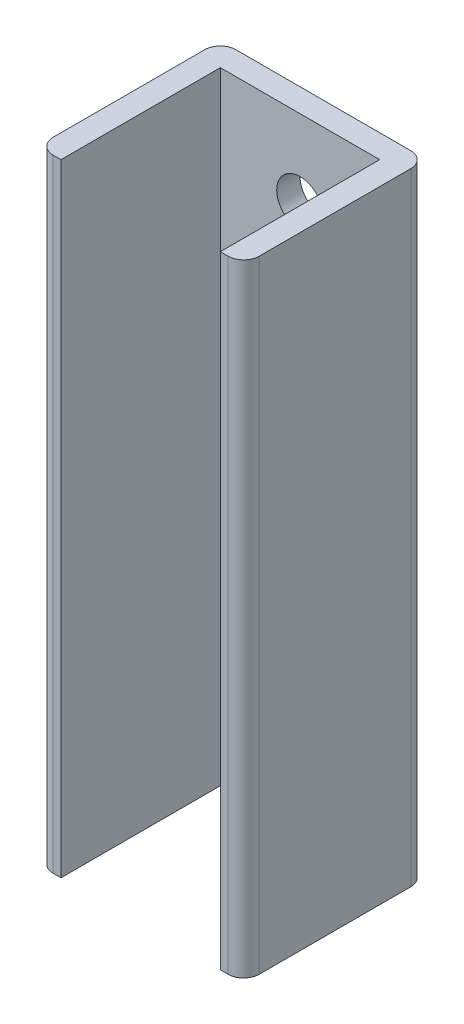
ISO-10303-21;
HEADER;
FILE_DESCRIPTION(('STEP AP214'),'2;1');
FILE_NAME('part.step','',(''),(''),'','','');
FILE_SCHEMA(('AUTOMOTIVE_DESIGN { 1 0 10303 214 1 1 1 1 }'));
ENDSEC;
DATA;
#1=APPLICATION_CONTEXT('core data for automotive mechanical design processes');
#2=APPLICATION_PROTOCOL_DEFINITION('international standard','automotive_design',2000,#1);
#3=PRODUCT_CONTEXT('',#1,'mechanical');
#4=PRODUCT('Part','Part','',(#3));
#5=PRODUCT_RELATED_PRODUCT_CATEGORY('part','',(#4));
#6=PRODUCT_DEFINITION_FORMATION('','',#4);
#7=PRODUCT_DEFINITION_CONTEXT('part definition',#1,'design');
#8=PRODUCT_DEFINITION('design','',#6,#7);
#9=PRODUCT_DEFINITION_SHAPE('','',#8);
#10=(LENGTH_UNIT() NAMED_UNIT(*) SI_UNIT(.MILLI.,.METRE.));
#11=(NAMED_UNIT(*) PLANE_ANGLE_UNIT() SI_UNIT($,.RADIAN.));
#12=(NAMED_UNIT(*) SI_UNIT($,.STERADIAN.) SOLID_ANGLE_UNIT());
#13=UNCERTAINTY_MEASURE_WITH_UNIT(LENGTH_MEASURE(1.E-05),#10,'distance_accuracy_value','');
#14=(GEOMETRIC_REPRESENTATION_CONTEXT(3) GLOBAL_UNCERTAINTY_ASSIGNED_CONTEXT((#13)) GLOBAL_UNIT_ASSIGNED_CONTEXT((#10,
#11,#12)) REPRESENTATION_CONTEXT('',''));
#15=CARTESIAN_POINT('',(0.,0.,0.));
#16=DIRECTION('',(0.,0.,1.));
#17=DIRECTION('',(1.,0.,0.));
#18=AXIS2_PLACEMENT_3D('',#15,#16,#17);
#19=CARTESIAN_POINT('',(0.,80.,-13.25));
#20=DIRECTION('',(0.,0.,-1.));
#21=DIRECTION('',(-1.,0.,0.));
#22=AXIS2_PLACEMENT_3D('',#19,#20,#21);
#23=PLANE('',#22);
#24=CARTESIAN_POINT('',(0.,70.,-13.25));
#25=DIRECTION('',(0.,0.,-1.));
#26=DIRECTION('',(-1.,0.,0.));
#27=AXIS2_PLACEMENT_3D('',#24,#25,#26);
#28=CIRCLE('',#27,3.);
#29=CARTESIAN_POINT('',(-3.,70.,-13.25));
#30=VERTEX_POINT('',#29);
#31=EDGE_CURVE('E241',#30,#30,#28,.T.);
#32=ORIENTED_EDGE('',*,*,#31,.F.);
#33=EDGE_LOOP('',(#32));
#34=FACE_BOUND('',#33,.T.);
#35=CARTESIAN_POINT('',(0.,10.,-13.25));
#36=DIRECTION('',(0.,0.,-1.));
#37=DIRECTION('',(-1.,0.,0.));
#38=AXIS2_PLACEMENT_3D('',#35,#36,#37);
#39=CIRCLE('',#38,3.);
#40=CARTESIAN_POINT('',(-3.00000000000001,10.,-13.25));
#41=VERTEX_POINT('',#40);
#42=EDGE_CURVE('E248',#41,#41,#39,.T.);
#43=ORIENTED_EDGE('',*,*,#42,.F.);
#44=EDGE_LOOP('',(#43));
#45=FACE_BOUND('',#44,.T.);
#46=DIRECTION('',(1.,0.,0.));
#47=VECTOR('',#46,1.);
#48=CARTESIAN_POINT('',(0.,0.,-13.25));
#49=LINE('',#48,#47);
#50=CARTESIAN_POINT('',(-11.25,0.,-13.25));
#51=VERTEX_POINT('',#50);
#52=CARTESIAN_POINT('',(11.25,0.,-13.25));
#53=VERTEX_POINT('',#52);
#54=EDGE_CURVE('E171',#51,#53,#49,.T.);
#55=ORIENTED_EDGE('',*,*,#54,.F.);
#56=DIRECTION('',(0.,-1.,0.));
#57=VECTOR('',#56,1.);
#58=CARTESIAN_POINT('',(-11.25,80.,-13.25));
#59=LINE('',#58,#57);
#60=CARTESIAN_POINT('',(-11.25,80.,-13.25));
#61=VERTEX_POINT('',#60);
#62=EDGE_CURVE('E11',#61,#51,#59,.T.);
#63=ORIENTED_EDGE('',*,*,#62,.F.);
#64=DIRECTION('',(1.,0.,0.));
#65=VECTOR('',#64,1.);
#66=CARTESIAN_POINT('',(0.,80.,-13.25));
#67=LINE('',#66,#65);
#68=CARTESIAN_POINT('',(11.25,80.,-13.25));
#69=VERTEX_POINT('',#68);
#70=EDGE_CURVE('E210',#61,#69,#67,.T.);
#71=ORIENTED_EDGE('',*,*,#70,.T.);
#72=DIRECTION('',(0.,-1.,0.));
#73=VECTOR('',#72,1.);
#74=CARTESIAN_POINT('',(11.25,80.,-13.25));
#75=LINE('',#74,#73);
#76=EDGE_CURVE('E60',#69,#53,#75,.T.);
#77=ORIENTED_EDGE('',*,*,#76,.T.);
#78=EDGE_LOOP('',(#55,#63,#71,#77));
#79=FACE_BOUND('',#78,.T.);
#80=ADVANCED_FACE('F41',(#34,#45,#79),#23,.T.);
#81=CARTESIAN_POINT('',(-11.25,80.,-11.25));
#82=DIRECTION('',(0.,-1.,0.));
#83=DIRECTION('',(0.,0.,-1.));
#84=AXIS2_PLACEMENT_3D('',#81,#82,#83);
#85=CYLINDRICAL_SURFACE('',#84,2.);
#86=CARTESIAN_POINT('',(-11.25,0.,-11.25));
#87=DIRECTION('',(0.,1.,0.));
#88=DIRECTION('',(0.,0.,1.));
#89=AXIS2_PLACEMENT_3D('',#86,#87,#88);
#90=CIRCLE('',#89,2.);
#91=CARTESIAN_POINT('',(-13.25,0.,-11.25));
#92=VERTEX_POINT('',#91);
#93=EDGE_CURVE('E174',#51,#92,#90,.T.);
#94=ORIENTED_EDGE('',*,*,#93,.T.);
#95=DIRECTION('',(0.,-1.,0.));
#96=VECTOR('',#95,1.);
#97=CARTESIAN_POINT('',(-13.25,80.,-11.25));
#98=LINE('',#97,#96);
#99=CARTESIAN_POINT('',(-13.25,80.,-11.25));
#100=VERTEX_POINT('',#99);
#101=EDGE_CURVE('E51',#100,#92,#98,.T.);
#102=ORIENTED_EDGE('',*,*,#101,.F.);
#103=CARTESIAN_POINT('',(-11.25,80.,-11.25));
#104=DIRECTION('',(0.,1.,0.));
#105=DIRECTION('',(0.,0.,1.));
#106=AXIS2_PLACEMENT_3D('',#103,#104,#105);
#107=CIRCLE('',#106,2.);
#108=EDGE_CURVE('E258',#61,#100,#107,.T.);
#109=ORIENTED_EDGE('',*,*,#108,.F.);
#110=ORIENTED_EDGE('',*,*,#62,.T.);
#111=EDGE_LOOP('',(#94,#102,#109,#110));
#112=FACE_BOUND('',#111,.T.);
#113=ADVANCED_FACE('F300',(#112),#85,.T.);
#114=CARTESIAN_POINT('',(-13.25,80.,0.));
#115=DIRECTION('',(-1.,0.,0.));
#116=DIRECTION('',(0.,0.,1.));
#117=AXIS2_PLACEMENT_3D('',#114,#115,#116);
#118=PLANE('',#117);
#119=DIRECTION('',(0.,0.,-1.));
#120=VECTOR('',#119,1.);
#121=CARTESIAN_POINT('',(-13.25,0.,0.));
#122=LINE('',#121,#120);
#123=CARTESIAN_POINT('',(-13.25,0.,8.24999999999999));
#124=VERTEX_POINT('',#123);
#125=EDGE_CURVE('E178',#124,#92,#122,.T.);
#126=ORIENTED_EDGE('',*,*,#125,.F.);
#127=DIRECTION('',(0.,-1.,0.));
#128=VECTOR('',#127,1.);
#129=CARTESIAN_POINT('',(-13.25,80.,8.24999999999999));
#130=LINE('',#129,#128);
#131=CARTESIAN_POINT('',(-13.25,80.,8.24999999999999));
#132=VERTEX_POINT('',#131);
#133=EDGE_CURVE('E234',#132,#124,#130,.T.);
#134=ORIENTED_EDGE('',*,*,#133,.F.);
#135=DIRECTION('',(0.,0.,-1.));
#136=VECTOR('',#135,1.);
#137=CARTESIAN_POINT('',(-13.25,80.,0.));
#138=LINE('',#137,#136);
#139=EDGE_CURVE('E261',#132,#100,#138,.T.);
#140=ORIENTED_EDGE('',*,*,#139,.T.);
#141=ORIENTED_EDGE('',*,*,#101,.T.);
#142=EDGE_LOOP('',(#126,#134,#140,#141));
#143=FACE_BOUND('',#142,.T.);
#144=ADVANCED_FACE('F305',(#143),#118,.T.);
#145=CARTESIAN_POINT('',(-11.25,80.,8.25));
#146=DIRECTION('',(0.,-1.,0.));
#147=DIRECTION('',(0.,0.,-1.));
#148=AXIS2_PLACEMENT_3D('',#145,#146,#147);
#149=CYLINDRICAL_SURFACE('',#148,2.);
#150=CARTESIAN_POINT('',(-11.25,0.,8.25));
#151=DIRECTION('',(0.,1.,0.));
#152=DIRECTION('',(0.,0.,1.));
#153=AXIS2_PLACEMENT_3D('',#150,#151,#152);
#154=CIRCLE('',#153,2.);
#155=CARTESIAN_POINT('',(-11.25,0.,10.25));
#156=VERTEX_POINT('',#155);
#157=EDGE_CURVE('E182',#156,#124,#154,.F.);
#158=ORIENTED_EDGE('',*,*,#157,.F.);
#159=DIRECTION('',(0.,-1.,0.));
#160=VECTOR('',#159,1.);
#161=CARTESIAN_POINT('',(-11.25,80.,10.25));
#162=LINE('',#161,#160);
#163=CARTESIAN_POINT('',(-11.25,80.,10.25));
#164=VERTEX_POINT('',#163);
#165=EDGE_CURVE('E231',#164,#156,#162,.T.);
#166=ORIENTED_EDGE('',*,*,#165,.F.);
#167=CARTESIAN_POINT('',(-11.25,80.,8.25));
#168=DIRECTION('',(0.,1.,0.));
#169=DIRECTION('',(0.,0.,1.));
#170=AXIS2_PLACEMENT_3D('',#167,#168,#169);
#171=CIRCLE('',#170,2.);
#172=EDGE_CURVE('E265',#164,#132,#171,.F.);
#173=ORIENTED_EDGE('',*,*,#172,.T.);
#174=ORIENTED_EDGE('',*,*,#133,.T.);
#175=EDGE_LOOP('',(#158,#166,#173,#174));
#176=FACE_BOUND('',#175,.T.);
#177=ADVANCED_FACE('F383',(#176),#149,.T.);
#178=CARTESIAN_POINT('',(0.,80.,10.25));
#179=DIRECTION('',(0.,0.,-1.));
#180=DIRECTION('',(-1.,0.,0.));
#181=AXIS2_PLACEMENT_3D('',#178,#179,#180);
#182=PLANE('',#181);
#183=DIRECTION('',(1.,0.,0.));
#184=VECTOR('',#183,1.);
#185=CARTESIAN_POINT('',(0.,0.,10.25));
#186=LINE('',#185,#184);
#187=CARTESIAN_POINT('',(-10.25,0.,10.25));
#188=VERTEX_POINT('',#187);
#189=EDGE_CURVE('E186',#156,#188,#186,.T.);
#190=ORIENTED_EDGE('',*,*,#189,.T.);
#191=DIRECTION('',(0.,-1.,0.));
#192=VECTOR('',#191,1.);
#193=CARTESIAN_POINT('',(-10.25,80.,10.25));
#194=LINE('',#193,#192);
#195=CARTESIAN_POINT('',(-10.25,80.,10.25));
#196=VERTEX_POINT('',#195);
#197=EDGE_CURVE('E227',#196,#188,#194,.T.);
#198=ORIENTED_EDGE('',*,*,#197,.F.);
#199=DIRECTION('',(1.,0.,0.));
#200=VECTOR('',#199,1.);
#201=CARTESIAN_POINT('',(0.,80.,10.25));
#202=LINE('',#201,#200);
#203=EDGE_CURVE('E165',#164,#196,#202,.T.);
#204=ORIENTED_EDGE('',*,*,#203,.F.);
#205=ORIENTED_EDGE('',*,*,#165,.T.);
#206=EDGE_LOOP('',(#190,#198,#204,#205));
#207=FACE_BOUND('',#206,.T.);
#208=ADVANCED_FACE('F354',(#207),#182,.F.);
#209=CARTESIAN_POINT('',(-10.25,80.,0.));
#210=DIRECTION('',(-1.,0.,0.));
#211=DIRECTION('',(0.,0.,1.));
#212=AXIS2_PLACEMENT_3D('',#209,#210,#211);
#213=PLANE('',#212);
#214=DIRECTION('',(0.,0.,-1.));
#215=VECTOR('',#214,1.);
#216=CARTESIAN_POINT('',(-10.25,0.,0.));
#217=LINE('',#216,#215);
#218=CARTESIAN_POINT('',(-10.25,0.,-10.25));
#219=VERTEX_POINT('',#218);
#220=EDGE_CURVE('E189',#188,#219,#217,.T.);
#221=ORIENTED_EDGE('',*,*,#220,.T.);
#222=DIRECTION('',(0.,-1.,0.));
#223=VECTOR('',#222,1.);
#224=CARTESIAN_POINT('',(-10.25,80.,-10.25));
#225=LINE('',#224,#223);
#226=CARTESIAN_POINT('',(-10.25,80.,-10.25));
#227=VERTEX_POINT('',#226);
#228=EDGE_CURVE('E223',#227,#219,#225,.T.);
#229=ORIENTED_EDGE('',*,*,#228,.F.);
#230=DIRECTION('',(0.,0.,-1.));
#231=VECTOR('',#230,1.);
#232=CARTESIAN_POINT('',(-10.25,80.,0.));
#233=LINE('',#232,#231);
#234=EDGE_CURVE('E270',#196,#227,#233,.T.);
#235=ORIENTED_EDGE('',*,*,#234,.F.);
#236=ORIENTED_EDGE('',*,*,#197,.T.);
#237=EDGE_LOOP('',(#221,#229,#235,#236));
#238=FACE_BOUND('',#237,.T.);
#239=ADVANCED_FACE('F369',(#238),#213,.F.);
#240=CARTESIAN_POINT('',(0.,80.,-10.25));
#241=DIRECTION('',(0.,0.,-1.));
#242=DIRECTION('',(-1.,0.,0.));
#243=AXIS2_PLACEMENT_3D('',#240,#241,#242);
#244=PLANE('',#243);
#245=CARTESIAN_POINT('',(0.,70.,-10.25));
#246=DIRECTION('',(0.,0.,-1.));
#247=DIRECTION('',(-1.,0.,0.));
#248=AXIS2_PLACEMENT_3D('',#245,#246,#247);
#249=CIRCLE('',#248,3.);
#250=CARTESIAN_POINT('',(-3.,70.,-10.25));
#251=VERTEX_POINT('',#250);
#252=EDGE_CURVE('E44',#251,#251,#249,.T.);
#253=ORIENTED_EDGE('',*,*,#252,.T.);
#254=EDGE_LOOP('',(#253));
#255=FACE_BOUND('',#254,.T.);
#256=CARTESIAN_POINT('',(0.,10.,-10.25));
#257=DIRECTION('',(0.,0.,-1.));
#258=DIRECTION('',(-1.,0.,0.));
#259=AXIS2_PLACEMENT_3D('',#256,#257,#258);
#260=CIRCLE('',#259,3.);
#261=CARTESIAN_POINT('',(-3.00000000000001,10.,-10.25));
#262=VERTEX_POINT('',#261);
#263=EDGE_CURVE('E238',#262,#262,#260,.T.);
#264=ORIENTED_EDGE('',*,*,#263,.T.);
#265=EDGE_LOOP('',(#264));
#266=FACE_BOUND('',#265,.T.);
#267=DIRECTION('',(1.,0.,0.));
#268=VECTOR('',#267,1.);
#269=CARTESIAN_POINT('',(0.,0.,-10.25));
#270=LINE('',#269,#268);
#271=CARTESIAN_POINT('',(10.25,0.,-10.25));
#272=VERTEX_POINT('',#271);
#273=EDGE_CURVE('E193',#219,#272,#270,.T.);
#274=ORIENTED_EDGE('',*,*,#273,.T.);
#275=DIRECTION('',(0.,-1.,0.));
#276=VECTOR('',#275,1.);
#277=CARTESIAN_POINT('',(10.25,80.,-10.25));
#278=LINE('',#277,#276);
#279=CARTESIAN_POINT('',(10.25,80.,-10.25));
#280=VERTEX_POINT('',#279);
#281=EDGE_CURVE('E220',#280,#272,#278,.T.);
#282=ORIENTED_EDGE('',*,*,#281,.F.);
#283=DIRECTION('',(1.,0.,0.));
#284=VECTOR('',#283,1.);
#285=CARTESIAN_POINT('',(0.,80.,-10.25));
#286=LINE('',#285,#284);
#287=EDGE_CURVE('E272',#227,#280,#286,.T.);
#288=ORIENTED_EDGE('',*,*,#287,.F.);
#289=ORIENTED_EDGE('',*,*,#228,.T.);
#290=EDGE_LOOP('',(#274,#282,#288,#289));
#291=FACE_BOUND('',#290,.T.);
#292=ADVANCED_FACE('F362',(#255,#266,#291),#244,.F.);
#293=CARTESIAN_POINT('',(10.25,80.,0.));
#294=DIRECTION('',(-1.,0.,0.));
#295=DIRECTION('',(0.,0.,1.));
#296=AXIS2_PLACEMENT_3D('',#293,#294,#295);
#297=PLANE('',#296);
#298=DIRECTION('',(0.,0.,-1.));
#299=VECTOR('',#298,1.);
#300=CARTESIAN_POINT('',(10.25,0.,0.));
#301=LINE('',#300,#299);
#302=CARTESIAN_POINT('',(10.25,0.,10.25));
#303=VERTEX_POINT('',#302);
#304=EDGE_CURVE('E197',#303,#272,#301,.T.);
#305=ORIENTED_EDGE('',*,*,#304,.F.);
#306=DIRECTION('',(0.,-1.,0.));
#307=VECTOR('',#306,1.);
#308=CARTESIAN_POINT('',(10.25,80.,10.25));
#309=LINE('',#308,#307);
#310=CARTESIAN_POINT('',(10.25,80.,10.25));
#311=VERTEX_POINT('',#310);
#312=EDGE_CURVE('E217',#311,#303,#309,.T.);
#313=ORIENTED_EDGE('',*,*,#312,.F.);
#314=DIRECTION('',(0.,0.,-1.));
#315=VECTOR('',#314,1.);
#316=CARTESIAN_POINT('',(10.25,80.,0.));
#317=LINE('',#316,#315);
#318=EDGE_CURVE('E163',#311,#280,#317,.T.);
#319=ORIENTED_EDGE('',*,*,#318,.T.);
#320=ORIENTED_EDGE('',*,*,#281,.T.);
#321=EDGE_LOOP('',(#305,#313,#319,#320));
#322=FACE_BOUND('',#321,.T.);
#323=ADVANCED_FACE('F280',(#322),#297,.T.);
#324=CARTESIAN_POINT('',(11.25,0.,10.25));
#325=VERTEX_POINT('',#324);
#326=EDGE_CURVE('E190',#303,#325,#186,.T.);
#327=ORIENTED_EDGE('',*,*,#326,.T.);
#328=DIRECTION('',(0.,-1.,0.));
#329=VECTOR('',#328,1.);
#330=CARTESIAN_POINT('',(11.25,80.,10.25));
#331=LINE('',#330,#329);
#332=CARTESIAN_POINT('',(11.25,80.,10.25));
#333=VERTEX_POINT('',#332);
#334=EDGE_CURVE('E145',#333,#325,#331,.T.);
#335=ORIENTED_EDGE('',*,*,#334,.F.);
#336=EDGE_CURVE('E158',#311,#333,#202,.T.);
#337=ORIENTED_EDGE('',*,*,#336,.F.);
#338=ORIENTED_EDGE('',*,*,#312,.T.);
#339=EDGE_LOOP('',(#327,#335,#337,#338));
#340=FACE_BOUND('',#339,.T.);
#341=ADVANCED_FACE('F284',(#340),#182,.F.);
#342=CARTESIAN_POINT('',(11.25,80.,8.25));
#343=DIRECTION('',(0.,-1.,0.));
#344=DIRECTION('',(0.,0.,-1.));
#345=AXIS2_PLACEMENT_3D('',#342,#343,#344);
#346=CYLINDRICAL_SURFACE('',#345,2.);
#347=CARTESIAN_POINT('',(11.25,0.,8.25));
#348=DIRECTION('',(0.,1.,0.));
#349=DIRECTION('',(0.,0.,1.));
#350=AXIS2_PLACEMENT_3D('',#347,#348,#349);
#351=CIRCLE('',#350,2.);
#352=CARTESIAN_POINT('',(13.25,0.,8.24999999999999));
#353=VERTEX_POINT('',#352);
#354=EDGE_CURVE('E141',#353,#325,#351,.F.);
#355=ORIENTED_EDGE('',*,*,#354,.F.);
#356=DIRECTION('',(0.,-1.,0.));
#357=VECTOR('',#356,1.);
#358=CARTESIAN_POINT('',(13.25,80.,8.24999999999999));
#359=LINE('',#358,#357);
#360=CARTESIAN_POINT('',(13.25,80.,8.24999999999999));
#361=VERTEX_POINT('',#360);
#362=EDGE_CURVE('E135',#361,#353,#359,.T.);
#363=ORIENTED_EDGE('',*,*,#362,.F.);
#364=CARTESIAN_POINT('',(11.25,80.,8.25));
#365=DIRECTION('',(0.,1.,0.));
#366=DIRECTION('',(0.,0.,1.));
#367=AXIS2_PLACEMENT_3D('',#364,#365,#366);
#368=CIRCLE('',#367,2.);
#369=EDGE_CURVE('E139',#361,#333,#368,.F.);
#370=ORIENTED_EDGE('',*,*,#369,.T.);
#371=ORIENTED_EDGE('',*,*,#334,.T.);
#372=EDGE_LOOP('',(#355,#363,#370,#371));
#373=FACE_BOUND('',#372,.T.);
#374=ADVANCED_FACE('F137',(#373),#346,.T.);
#375=CARTESIAN_POINT('',(13.25,80.,0.));
#376=DIRECTION('',(-1.,0.,0.));
#377=DIRECTION('',(0.,0.,1.));
#378=AXIS2_PLACEMENT_3D('',#375,#376,#377);
#379=PLANE('',#378);
#380=DIRECTION('',(0.,0.,-1.));
#381=VECTOR('',#380,1.);
#382=CARTESIAN_POINT('',(13.25,0.,0.));
#383=LINE('',#382,#381);
#384=CARTESIAN_POINT('',(13.25,0.,-11.25));
#385=VERTEX_POINT('',#384);
#386=EDGE_CURVE('E203',#353,#385,#383,.T.);
#387=ORIENTED_EDGE('',*,*,#386,.T.);
#388=DIRECTION('',(0.,-1.,0.));
#389=VECTOR('',#388,1.);
#390=CARTESIAN_POINT('',(13.25,80.,-11.25));
#391=LINE('',#390,#389);
#392=CARTESIAN_POINT('',(13.25,80.,-11.25));
#393=VERTEX_POINT('',#392);
#394=EDGE_CURVE('E98',#393,#385,#391,.T.);
#395=ORIENTED_EDGE('',*,*,#394,.F.);
#396=DIRECTION('',(0.,0.,-1.));
#397=VECTOR('',#396,1.);
#398=CARTESIAN_POINT('',(13.25,80.,0.));
#399=LINE('',#398,#397);
#400=EDGE_CURVE('E147',#361,#393,#399,.T.);
#401=ORIENTED_EDGE('',*,*,#400,.F.);
#402=ORIENTED_EDGE('',*,*,#362,.T.);
#403=EDGE_LOOP('',(#387,#395,#401,#402));
#404=FACE_BOUND('',#403,.T.);
#405=ADVANCED_FACE('F148',(#404),#379,.F.);
#406=CARTESIAN_POINT('',(11.25,80.,-11.25));
#407=DIRECTION('',(0.,-1.,0.));
#408=DIRECTION('',(0.,0.,-1.));
#409=AXIS2_PLACEMENT_3D('',#406,#407,#408);
#410=CYLINDRICAL_SURFACE('',#409,2.);
#411=CARTESIAN_POINT('',(11.25,0.,-11.25));
#412=DIRECTION('',(0.,1.,0.));
#413=DIRECTION('',(0.,0.,1.));
#414=AXIS2_PLACEMENT_3D('',#411,#412,#413);
#415=CIRCLE('',#414,2.);
#416=EDGE_CURVE('E206',#53,#385,#415,.F.);
#417=ORIENTED_EDGE('',*,*,#416,.F.);
#418=ORIENTED_EDGE('',*,*,#76,.F.);
#419=CARTESIAN_POINT('',(11.25,80.,-11.25));
#420=DIRECTION('',(0.,1.,0.));
#421=DIRECTION('',(0.,0.,1.));
#422=AXIS2_PLACEMENT_3D('',#419,#420,#421);
#423=CIRCLE('',#422,2.);
#424=EDGE_CURVE('E152',#69,#393,#423,.F.);
#425=ORIENTED_EDGE('',*,*,#424,.T.);
#426=ORIENTED_EDGE('',*,*,#394,.T.);
#427=EDGE_LOOP('',(#417,#418,#425,#426));
#428=FACE_BOUND('',#427,.T.);
#429=ADVANCED_FACE('F289',(#428),#410,.T.);
#430=CARTESIAN_POINT('',(0.,80.,0.));
#431=DIRECTION('',(0.,1.,0.));
#432=DIRECTION('',(0.,0.,1.));
#433=AXIS2_PLACEMENT_3D('',#430,#431,#432);
#434=PLANE('',#433);
#435=ORIENTED_EDGE('',*,*,#70,.F.);
#436=ORIENTED_EDGE('',*,*,#108,.T.);
#437=ORIENTED_EDGE('',*,*,#139,.F.);
#438=ORIENTED_EDGE('',*,*,#172,.F.);
#439=ORIENTED_EDGE('',*,*,#203,.T.);
#440=ORIENTED_EDGE('',*,*,#234,.T.);
#441=ORIENTED_EDGE('',*,*,#287,.T.);
#442=ORIENTED_EDGE('',*,*,#318,.F.);
#443=ORIENTED_EDGE('',*,*,#336,.T.);
#444=ORIENTED_EDGE('',*,*,#369,.F.);
#445=ORIENTED_EDGE('',*,*,#400,.T.);
#446=ORIENTED_EDGE('',*,*,#424,.F.);
#447=EDGE_LOOP('',(#435,#436,#437,#438,#439,#440,#441,#442,#443,#444,#445,#446));
#448=FACE_BOUND('',#447,.T.);
#449=ADVANCED_FACE('F155',(#448),#434,.T.);
#450=CARTESIAN_POINT('',(0.,0.,0.));
#451=DIRECTION('',(0.,1.,0.));
#452=DIRECTION('',(0.,0.,1.));
#453=AXIS2_PLACEMENT_3D('',#450,#451,#452);
#454=PLANE('',#453);
#455=ORIENTED_EDGE('',*,*,#54,.T.);
#456=ORIENTED_EDGE('',*,*,#416,.T.);
#457=ORIENTED_EDGE('',*,*,#386,.F.);
#458=ORIENTED_EDGE('',*,*,#354,.T.);
#459=ORIENTED_EDGE('',*,*,#326,.F.);
#460=ORIENTED_EDGE('',*,*,#304,.T.);
#461=ORIENTED_EDGE('',*,*,#273,.F.);
#462=ORIENTED_EDGE('',*,*,#220,.F.);
#463=ORIENTED_EDGE('',*,*,#189,.F.);
#464=ORIENTED_EDGE('',*,*,#157,.T.);
#465=ORIENTED_EDGE('',*,*,#125,.T.);
#466=ORIENTED_EDGE('',*,*,#93,.F.);
#467=EDGE_LOOP('',(#455,#456,#457,#458,#459,#460,#461,#462,#463,#464,#465,#466));
#468=FACE_BOUND('',#467,.T.);
#469=ADVANCED_FACE('F287',(#468),#454,.F.);
#470=CARTESIAN_POINT('',(0.,10.,12.75));
#471=DIRECTION('',(0.,0.,-1.));
#472=DIRECTION('',(-1.,0.,0.));
#473=AXIS2_PLACEMENT_3D('',#470,#471,#472);
#474=CYLINDRICAL_SURFACE('',#473,3.);
#475=ORIENTED_EDGE('',*,*,#42,.T.);
#476=EDGE_LOOP('',(#475));
#477=FACE_BOUND('',#476,.T.);
#478=ORIENTED_EDGE('',*,*,#263,.F.);
#479=EDGE_LOOP('',(#478));
#480=FACE_BOUND('',#479,.T.);
#481=ADVANCED_FACE('F310',(#477,#480),#474,.F.);
#482=CARTESIAN_POINT('',(0.,70.,12.75));
#483=DIRECTION('',(0.,0.,-1.));
#484=DIRECTION('',(-1.,0.,0.));
#485=AXIS2_PLACEMENT_3D('',#482,#483,#484);
#486=CYLINDRICAL_SURFACE('',#485,3.);
#487=ORIENTED_EDGE('',*,*,#31,.T.);
#488=EDGE_LOOP('',(#487));
#489=FACE_BOUND('',#488,.T.);
#490=ORIENTED_EDGE('',*,*,#252,.F.);
#491=EDGE_LOOP('',(#490));
#492=FACE_BOUND('',#491,.T.);
#493=ADVANCED_FACE('F313',(#489,#492),#486,.F.);
#494=CLOSED_SHELL('',(#80,#113,#144,#177,#208,#239,#292,#323,#341,#374,#405,#429,#449,#469,#481,#493));
#495=MANIFOLD_SOLID_BREP('B2',#494);
#496=ADVANCED_BREP_SHAPE_REPRESENTATION('',(#18,#495),#14);
#497=SHAPE_DEFINITION_REPRESENTATION(#9,#496);
ENDSEC;
END-ISO-10303-21;
